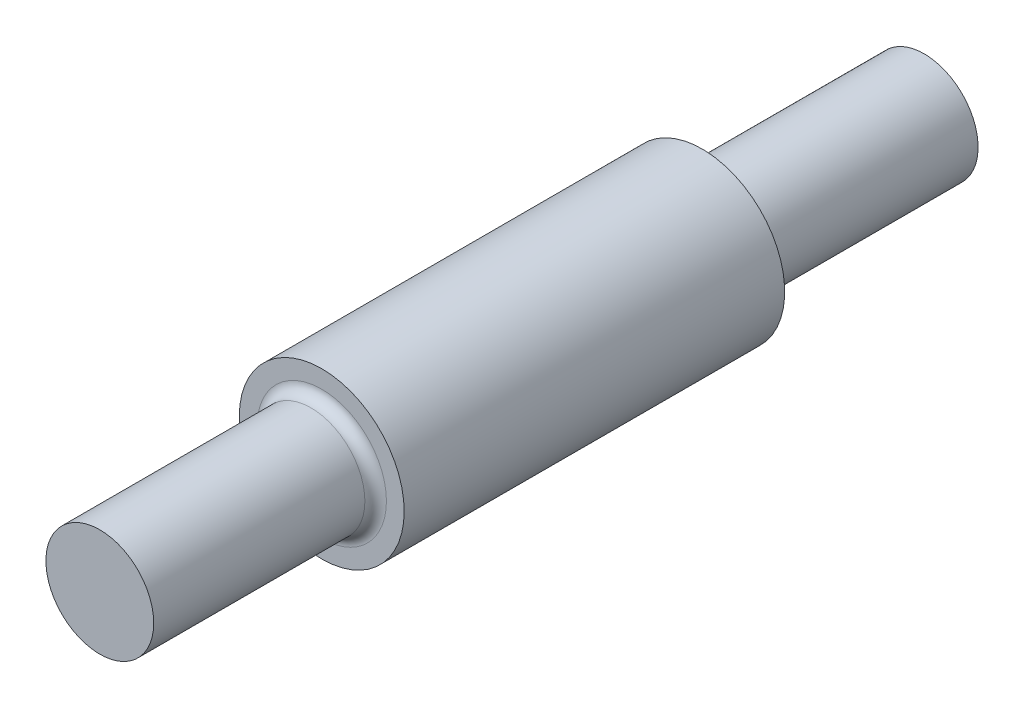
ISO-10303-21;
HEADER;
FILE_DESCRIPTION(('STEP AP214'),'2;1');
FILE_NAME('part.step','',(''),(''),'','','');
FILE_SCHEMA(('AUTOMOTIVE_DESIGN { 1 0 10303 214 1 1 1 1 }'));
ENDSEC;
DATA;
#1=APPLICATION_CONTEXT('core data for automotive mechanical design processes');
#2=APPLICATION_PROTOCOL_DEFINITION('international standard','automotive_design',2000,#1);
#3=PRODUCT_CONTEXT('',#1,'mechanical');
#4=PRODUCT('Part','Part','',(#3));
#5=PRODUCT_RELATED_PRODUCT_CATEGORY('part','',(#4));
#6=PRODUCT_DEFINITION_FORMATION('','',#4);
#7=PRODUCT_DEFINITION_CONTEXT('part definition',#1,'design');
#8=PRODUCT_DEFINITION('design','',#6,#7);
#9=PRODUCT_DEFINITION_SHAPE('','',#8);
#10=(LENGTH_UNIT() NAMED_UNIT(*) SI_UNIT(.MILLI.,.METRE.));
#11=(NAMED_UNIT(*) PLANE_ANGLE_UNIT() SI_UNIT($,.RADIAN.));
#12=(NAMED_UNIT(*) SI_UNIT($,.STERADIAN.) SOLID_ANGLE_UNIT());
#13=UNCERTAINTY_MEASURE_WITH_UNIT(LENGTH_MEASURE(1.E-05),#10,'distance_accuracy_value','');
#14=(GEOMETRIC_REPRESENTATION_CONTEXT(3) GLOBAL_UNCERTAINTY_ASSIGNED_CONTEXT((#13)) GLOBAL_UNIT_ASSIGNED_CONTEXT((#10,
#11,#12)) REPRESENTATION_CONTEXT('',''));
#15=CARTESIAN_POINT('',(0.,0.,0.));
#16=DIRECTION('',(0.,0.,1.));
#17=DIRECTION('',(1.,0.,0.));
#18=AXIS2_PLACEMENT_3D('',#15,#16,#17);
#19=CARTESIAN_POINT('',(0.,0.,130.));
#20=DIRECTION('',(0.,0.,-1.));
#21=DIRECTION('',(-1.,0.,0.));
#22=AXIS2_PLACEMENT_3D('',#19,#20,#21);
#23=CYLINDRICAL_SURFACE('',#22,13.);
#24=CARTESIAN_POINT('',(0.,0.,95.));
#25=DIRECTION('',(0.,0.,1.));
#26=DIRECTION('',(1.,0.,0.));
#27=AXIS2_PLACEMENT_3D('',#24,#25,#26);
#28=CIRCLE('',#27,13.);
#29=CARTESIAN_POINT('',(13.,0.,95.));
#30=VERTEX_POINT('',#29);
#31=EDGE_CURVE('E60',#30,#30,#28,.T.);
#32=ORIENTED_EDGE('',*,*,#31,.F.);
#33=EDGE_LOOP('',(#32));
#34=FACE_BOUND('',#33,.T.);
#35=CARTESIAN_POINT('',(0.,0.,35.));
#36=DIRECTION('',(0.,0.,-1.));
#37=DIRECTION('',(-1.,0.,0.));
#38=AXIS2_PLACEMENT_3D('',#35,#36,#37);
#39=CIRCLE('',#38,13.);
#40=CARTESIAN_POINT('',(-13.,0.,35.));
#41=VERTEX_POINT('',#40);
#42=EDGE_CURVE('E68',#41,#41,#39,.T.);
#43=ORIENTED_EDGE('',*,*,#42,.F.);
#44=EDGE_LOOP('',(#43));
#45=FACE_BOUND('',#44,.T.);
#46=ADVANCED_FACE('F36',(#34,#45),#23,.T.);
#47=CARTESIAN_POINT('',(0.,0.,95.));
#48=DIRECTION('',(0.,0.,1.));
#49=DIRECTION('',(1.,0.,0.));
#50=AXIS2_PLACEMENT_3D('',#47,#48,#49);
#51=PLANE('',#50);
#52=CARTESIAN_POINT('',(0.,0.,95.));
#53=DIRECTION('',(0.,0.,1.));
#54=DIRECTION('',(1.,0.,0.));
#55=AXIS2_PLACEMENT_3D('',#52,#53,#54);
#56=CIRCLE('',#55,10.2);
#57=CARTESIAN_POINT('',(10.2,0.,95.));
#58=VERTEX_POINT('',#57);
#59=EDGE_CURVE('E49',#58,#58,#56,.F.);
#60=ORIENTED_EDGE('',*,*,#59,.T.);
#61=EDGE_LOOP('',(#60));
#62=FACE_BOUND('',#61,.T.);
#63=ORIENTED_EDGE('',*,*,#31,.T.);
#64=EDGE_LOOP('',(#63));
#65=FACE_BOUND('',#64,.T.);
#66=ADVANCED_FACE('F93',(#62,#65),#51,.T.);
#67=CARTESIAN_POINT('',(0.,0.,95.));
#68=DIRECTION('',(0.,0.,1.));
#69=DIRECTION('',(1.,0.,0.));
#70=AXIS2_PLACEMENT_3D('',#67,#68,#69);
#71=CYLINDRICAL_SURFACE('',#70,8.5);
#72=CARTESIAN_POINT('',(0.,0.,96.7));
#73=DIRECTION('',(0.,0.,1.));
#74=DIRECTION('',(1.,0.,0.));
#75=AXIS2_PLACEMENT_3D('',#72,#73,#74);
#76=CIRCLE('',#75,8.5);
#77=CARTESIAN_POINT('',(8.5,0.,96.7));
#78=VERTEX_POINT('',#77);
#79=EDGE_CURVE('E54',#78,#78,#76,.T.);
#80=ORIENTED_EDGE('',*,*,#79,.T.);
#81=EDGE_LOOP('',(#80));
#82=FACE_BOUND('',#81,.T.);
#83=CARTESIAN_POINT('',(0.,0.,130.));
#84=DIRECTION('',(0.,0.,1.));
#85=DIRECTION('',(1.,0.,0.));
#86=AXIS2_PLACEMENT_3D('',#83,#84,#85);
#87=CIRCLE('',#86,8.5);
#88=CARTESIAN_POINT('',(8.5,0.,130.));
#89=VERTEX_POINT('',#88);
#90=EDGE_CURVE('E64',#89,#89,#87,.T.);
#91=ORIENTED_EDGE('',*,*,#90,.F.);
#92=EDGE_LOOP('',(#91));
#93=FACE_BOUND('',#92,.T.);
#94=ADVANCED_FACE('F100',(#82,#93),#71,.T.);
#95=CARTESIAN_POINT('',(0.,0.,130.));
#96=DIRECTION('',(0.,0.,1.));
#97=DIRECTION('',(1.,0.,0.));
#98=AXIS2_PLACEMENT_3D('',#95,#96,#97);
#99=PLANE('',#98);
#100=ORIENTED_EDGE('',*,*,#90,.T.);
#101=EDGE_LOOP('',(#100));
#102=FACE_BOUND('',#101,.T.);
#103=ADVANCED_FACE('F90',(#102),#99,.T.);
#104=CARTESIAN_POINT('',(0.,0.,35.));
#105=DIRECTION('',(0.,0.,-1.));
#106=DIRECTION('',(-1.,0.,0.));
#107=AXIS2_PLACEMENT_3D('',#104,#105,#106);
#108=PLANE('',#107);
#109=CARTESIAN_POINT('',(0.,0.,35.));
#110=DIRECTION('',(0.,0.,-1.));
#111=DIRECTION('',(-1.,0.,0.));
#112=AXIS2_PLACEMENT_3D('',#109,#110,#111);
#113=CIRCLE('',#112,10.2);
#114=CARTESIAN_POINT('',(-10.2,0.,35.));
#115=VERTEX_POINT('',#114);
#116=EDGE_CURVE('E10',#115,#115,#113,.F.);
#117=ORIENTED_EDGE('',*,*,#116,.T.);
#118=EDGE_LOOP('',(#117));
#119=FACE_BOUND('',#118,.T.);
#120=ORIENTED_EDGE('',*,*,#42,.T.);
#121=EDGE_LOOP('',(#120));
#122=FACE_BOUND('',#121,.T.);
#123=ADVANCED_FACE('F81',(#119,#122),#108,.T.);
#124=CARTESIAN_POINT('',(0.,0.,35.));
#125=DIRECTION('',(0.,0.,-1.));
#126=DIRECTION('',(-1.,0.,0.));
#127=AXIS2_PLACEMENT_3D('',#124,#125,#126);
#128=CYLINDRICAL_SURFACE('',#127,8.5);
#129=CARTESIAN_POINT('',(0.,0.,33.3));
#130=DIRECTION('',(0.,0.,-1.));
#131=DIRECTION('',(-1.,0.,0.));
#132=AXIS2_PLACEMENT_3D('',#129,#130,#131);
#133=CIRCLE('',#132,8.5);
#134=CARTESIAN_POINT('',(-8.5,0.,33.3));
#135=VERTEX_POINT('',#134);
#136=EDGE_CURVE('E44',#135,#135,#133,.T.);
#137=ORIENTED_EDGE('',*,*,#136,.T.);
#138=EDGE_LOOP('',(#137));
#139=FACE_BOUND('',#138,.T.);
#140=CARTESIAN_POINT('',(0.,0.,0.));
#141=DIRECTION('',(0.,0.,-1.));
#142=DIRECTION('',(-1.,0.,0.));
#143=AXIS2_PLACEMENT_3D('',#140,#141,#142);
#144=CIRCLE('',#143,8.5);
#145=CARTESIAN_POINT('',(-8.5,0.,0.));
#146=VERTEX_POINT('',#145);
#147=EDGE_CURVE('E72',#146,#146,#144,.T.);
#148=ORIENTED_EDGE('',*,*,#147,.F.);
#149=EDGE_LOOP('',(#148));
#150=FACE_BOUND('',#149,.T.);
#151=ADVANCED_FACE('F79',(#139,#150),#128,.T.);
#152=CARTESIAN_POINT('',(0.,0.,0.));
#153=DIRECTION('',(0.,0.,1.));
#154=DIRECTION('',(1.,0.,0.));
#155=AXIS2_PLACEMENT_3D('',#152,#153,#154);
#156=PLANE('',#155);
#157=ORIENTED_EDGE('',*,*,#147,.T.);
#158=EDGE_LOOP('',(#157));
#159=FACE_BOUND('',#158,.T.);
#160=ADVANCED_FACE('F77',(#159),#156,.F.);
#161=CARTESIAN_POINT('',(0.,0.,96.7));
#162=DIRECTION('',(0.,0.,1.));
#163=DIRECTION('',(1.,0.,0.));
#164=AXIS2_PLACEMENT_3D('',#161,#162,#163);
#165=TOROIDAL_SURFACE('',#164,10.2,1.7);
#166=ORIENTED_EDGE('',*,*,#59,.F.);
#167=EDGE_LOOP('',(#166));
#168=FACE_BOUND('',#167,.T.);
#169=ORIENTED_EDGE('',*,*,#79,.F.);
#170=EDGE_LOOP('',(#169));
#171=FACE_BOUND('',#170,.T.);
#172=ADVANCED_FACE('F88',(#168,#171),#165,.F.);
#173=CARTESIAN_POINT('',(0.,0.,33.3));
#174=DIRECTION('',(0.,0.,-1.));
#175=DIRECTION('',(-1.,0.,0.));
#176=AXIS2_PLACEMENT_3D('',#173,#174,#175);
#177=TOROIDAL_SURFACE('',#176,10.2,1.7);
#178=ORIENTED_EDGE('',*,*,#116,.F.);
#179=EDGE_LOOP('',(#178));
#180=FACE_BOUND('',#179,.T.);
#181=ORIENTED_EDGE('',*,*,#136,.F.);
#182=EDGE_LOOP('',(#181));
#183=FACE_BOUND('',#182,.T.);
#184=ADVANCED_FACE('F38',(#180,#183),#177,.F.);
#185=CLOSED_SHELL('',(#46,#66,#94,#103,#123,#151,#160,#172,#184));
#186=MANIFOLD_SOLID_BREP('B2',#185);
#187=ADVANCED_BREP_SHAPE_REPRESENTATION('',(#18,#186),#14);
#188=SHAPE_DEFINITION_REPRESENTATION(#9,#187);
ENDSEC;
END-ISO-10303-21;
